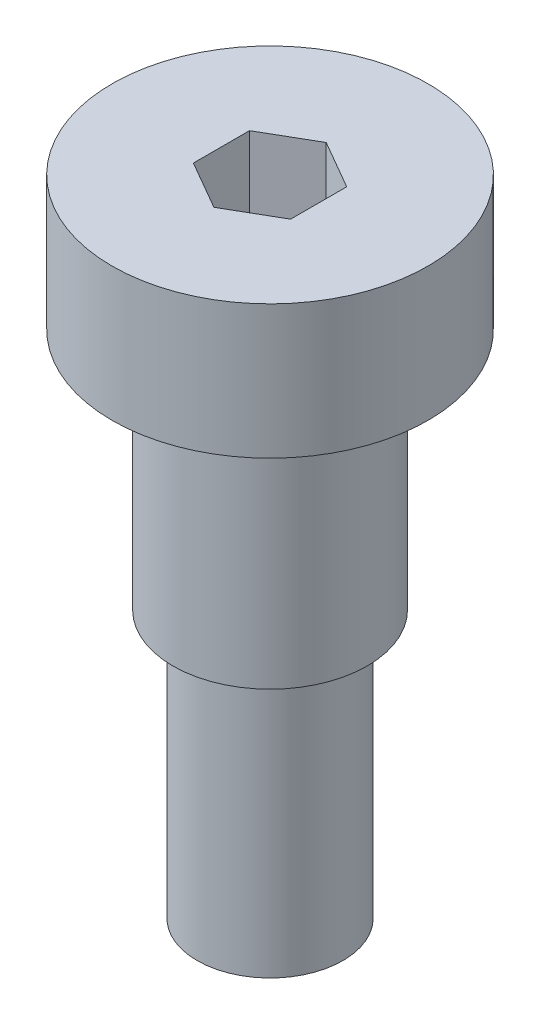
ISO-10303-21;
HEADER;
FILE_DESCRIPTION(('STEP AP214'),'2;1');
FILE_NAME('part.step','',(''),(''),'','','');
FILE_SCHEMA(('AUTOMOTIVE_DESIGN { 1 0 10303 214 1 1 1 1 }'));
ENDSEC;
DATA;
#1=APPLICATION_CONTEXT('core data for automotive mechanical design processes');
#2=APPLICATION_PROTOCOL_DEFINITION('international standard','automotive_design',2000,#1);
#3=PRODUCT_CONTEXT('',#1,'mechanical');
#4=PRODUCT('Part','Part','',(#3));
#5=PRODUCT_RELATED_PRODUCT_CATEGORY('part','',(#4));
#6=PRODUCT_DEFINITION_FORMATION('','',#4);
#7=PRODUCT_DEFINITION_CONTEXT('part definition',#1,'design');
#8=PRODUCT_DEFINITION('design','',#6,#7);
#9=PRODUCT_DEFINITION_SHAPE('','',#8);
#10=(LENGTH_UNIT() NAMED_UNIT(*) SI_UNIT(.MILLI.,.METRE.));
#11=(NAMED_UNIT(*) PLANE_ANGLE_UNIT() SI_UNIT($,.RADIAN.));
#12=(NAMED_UNIT(*) SI_UNIT($,.STERADIAN.) SOLID_ANGLE_UNIT());
#13=UNCERTAINTY_MEASURE_WITH_UNIT(LENGTH_MEASURE(1.E-05),#10,'distance_accuracy_value','');
#14=(GEOMETRIC_REPRESENTATION_CONTEXT(3) GLOBAL_UNCERTAINTY_ASSIGNED_CONTEXT((#13)) GLOBAL_UNIT_ASSIGNED_CONTEXT((#10,
#11,#12)) REPRESENTATION_CONTEXT('',''));
#15=CARTESIAN_POINT('',(0.,0.,0.));
#16=DIRECTION('',(0.,0.,1.));
#17=DIRECTION('',(1.,0.,0.));
#18=AXIS2_PLACEMENT_3D('',#15,#16,#17);
#19=CARTESIAN_POINT('',(0.,5.5,0.));
#20=DIRECTION('',(0.,-1.,0.));
#21=DIRECTION('',(0.,0.,-1.));
#22=AXIS2_PLACEMENT_3D('',#19,#20,#21);
#23=PLANE('',#22);
#24=DIRECTION('',(0.866025403784439,0.,-0.5));
#25=VECTOR('',#24,1.);
#26=CARTESIAN_POINT('',(0.,5.5,2.3094010767585));
#27=LINE('',#26,#25);
#28=CARTESIAN_POINT('',(0.,5.5,2.3094010767585));
#29=VERTEX_POINT('',#28);
#30=CARTESIAN_POINT('',(2.,5.5,1.15470053837925));
#31=VERTEX_POINT('',#30);
#32=EDGE_CURVE('E122',#29,#31,#27,.T.);
#33=ORIENTED_EDGE('',*,*,#32,.F.);
#34=DIRECTION('',(0.866025403784439,0.,0.5));
#35=VECTOR('',#34,1.);
#36=CARTESIAN_POINT('',(-2.,5.5,1.15470053837925));
#37=LINE('',#36,#35);
#38=CARTESIAN_POINT('',(-2.,5.5,1.15470053837925));
#39=VERTEX_POINT('',#38);
#40=EDGE_CURVE('E48',#39,#29,#37,.T.);
#41=ORIENTED_EDGE('',*,*,#40,.F.);
#42=DIRECTION('',(0.,0.,1.));
#43=VECTOR('',#42,1.);
#44=CARTESIAN_POINT('',(-2.,5.5,-1.15470053837925));
#45=LINE('',#44,#43);
#46=CARTESIAN_POINT('',(-2.,5.5,-1.15470053837925));
#47=VERTEX_POINT('',#46);
#48=EDGE_CURVE('E131',#47,#39,#45,.T.);
#49=ORIENTED_EDGE('',*,*,#48,.F.);
#50=DIRECTION('',(-0.866025403784439,0.,0.5));
#51=VECTOR('',#50,1.);
#52=CARTESIAN_POINT('',(0.,5.5,-2.3094010767585));
#53=LINE('',#52,#51);
#54=CARTESIAN_POINT('',(0.,5.5,-2.3094010767585));
#55=VERTEX_POINT('',#54);
#56=EDGE_CURVE('E129',#55,#47,#53,.T.);
#57=ORIENTED_EDGE('',*,*,#56,.F.);
#58=DIRECTION('',(-0.866025403784439,0.,-0.5));
#59=VECTOR('',#58,1.);
#60=CARTESIAN_POINT('',(2.,5.5,-1.15470053837925));
#61=LINE('',#60,#59);
#62=CARTESIAN_POINT('',(2.,5.5,-1.15470053837925));
#63=VERTEX_POINT('',#62);
#64=EDGE_CURVE('E96',#63,#55,#61,.T.);
#65=ORIENTED_EDGE('',*,*,#64,.F.);
#66=DIRECTION('',(0.,0.,-1.));
#67=VECTOR('',#66,1.);
#68=CARTESIAN_POINT('',(2.,5.5,1.15470053837925));
#69=LINE('',#68,#67);
#70=EDGE_CURVE('E125',#31,#63,#69,.T.);
#71=ORIENTED_EDGE('',*,*,#70,.F.);
#72=EDGE_LOOP('',(#33,#41,#49,#57,#65,#71));
#73=FACE_BOUND('',#72,.T.);
#74=CARTESIAN_POINT('',(0.,5.5,0.));
#75=DIRECTION('',(0.,1.,0.));
#76=DIRECTION('',(0.,0.,1.));
#77=AXIS2_PLACEMENT_3D('',#74,#75,#76);
#78=CIRCLE('',#77,6.5);
#79=CARTESIAN_POINT('',(0.,5.5,6.5));
#80=VERTEX_POINT('',#79);
#81=EDGE_CURVE('E11',#80,#80,#78,.T.);
#82=ORIENTED_EDGE('',*,*,#81,.T.);
#83=EDGE_LOOP('',(#82));
#84=FACE_BOUND('',#83,.T.);
#85=ADVANCED_FACE('F34',(#73,#84),#23,.F.);
#86=CARTESIAN_POINT('',(0.,24.8323599523242,0.));
#87=DIRECTION('',(0.,1.,0.));
#88=DIRECTION('',(0.,0.,1.));
#89=AXIS2_PLACEMENT_3D('',#86,#87,#88);
#90=CYLINDRICAL_SURFACE('',#89,6.5);
#91=ORIENTED_EDGE('',*,*,#81,.F.);
#92=EDGE_LOOP('',(#91));
#93=FACE_BOUND('',#92,.T.);
#94=CARTESIAN_POINT('',(0.,0.,0.));
#95=DIRECTION('',(0.,1.,0.));
#96=DIRECTION('',(0.,0.,1.));
#97=AXIS2_PLACEMENT_3D('',#94,#95,#96);
#98=CIRCLE('',#97,6.5);
#99=CARTESIAN_POINT('',(0.,0.,6.5));
#100=VERTEX_POINT('',#99);
#101=EDGE_CURVE('E41',#100,#100,#98,.T.);
#102=ORIENTED_EDGE('',*,*,#101,.T.);
#103=EDGE_LOOP('',(#102));
#104=FACE_BOUND('',#103,.T.);
#105=ADVANCED_FACE('F154',(#93,#104),#90,.T.);
#106=CARTESIAN_POINT('',(6.5,0.,0.));
#107=DIRECTION('',(0.,1.,0.));
#108=DIRECTION('',(0.,0.,1.));
#109=AXIS2_PLACEMENT_3D('',#106,#107,#108);
#110=PLANE('',#109);
#111=ORIENTED_EDGE('',*,*,#101,.F.);
#112=EDGE_LOOP('',(#111));
#113=FACE_BOUND('',#112,.T.);
#114=CARTESIAN_POINT('',(0.,0.,0.));
#115=DIRECTION('',(0.,1.,0.));
#116=DIRECTION('',(0.,0.,1.));
#117=AXIS2_PLACEMENT_3D('',#114,#115,#116);
#118=CIRCLE('',#117,4.);
#119=CARTESIAN_POINT('',(0.,0.,4.));
#120=VERTEX_POINT('',#119);
#121=EDGE_CURVE('E149',#120,#120,#118,.T.);
#122=ORIENTED_EDGE('',*,*,#121,.T.);
#123=EDGE_LOOP('',(#122));
#124=FACE_BOUND('',#123,.T.);
#125=ADVANCED_FACE('F156',(#113,#124),#110,.F.);
#126=CARTESIAN_POINT('',(0.,24.8323599523242,0.));
#127=DIRECTION('',(0.,1.,0.));
#128=DIRECTION('',(0.,0.,1.));
#129=AXIS2_PLACEMENT_3D('',#126,#127,#128);
#130=CYLINDRICAL_SURFACE('',#129,4.);
#131=ORIENTED_EDGE('',*,*,#121,.F.);
#132=EDGE_LOOP('',(#131));
#133=FACE_BOUND('',#132,.T.);
#134=CARTESIAN_POINT('',(0.,-10.,0.));
#135=DIRECTION('',(0.,1.,0.));
#136=DIRECTION('',(0.,0.,1.));
#137=AXIS2_PLACEMENT_3D('',#134,#135,#136);
#138=CIRCLE('',#137,4.);
#139=CARTESIAN_POINT('',(0.,-10.,4.));
#140=VERTEX_POINT('',#139);
#141=EDGE_CURVE('E146',#140,#140,#138,.T.);
#142=ORIENTED_EDGE('',*,*,#141,.T.);
#143=EDGE_LOOP('',(#142));
#144=FACE_BOUND('',#143,.T.);
#145=ADVANCED_FACE('F159',(#133,#144),#130,.T.);
#146=CARTESIAN_POINT('',(4.,-10.,0.));
#147=DIRECTION('',(0.,1.,0.));
#148=DIRECTION('',(0.,0.,1.));
#149=AXIS2_PLACEMENT_3D('',#146,#147,#148);
#150=PLANE('',#149);
#151=ORIENTED_EDGE('',*,*,#141,.F.);
#152=EDGE_LOOP('',(#151));
#153=FACE_BOUND('',#152,.T.);
#154=CARTESIAN_POINT('',(0.,-10.,0.));
#155=DIRECTION('',(0.,1.,0.));
#156=DIRECTION('',(0.,0.,1.));
#157=AXIS2_PLACEMENT_3D('',#154,#155,#156);
#158=CIRCLE('',#157,3.);
#159=CARTESIAN_POINT('',(0.,-10.,3.));
#160=VERTEX_POINT('',#159);
#161=EDGE_CURVE('E143',#160,#160,#158,.T.);
#162=ORIENTED_EDGE('',*,*,#161,.T.);
#163=EDGE_LOOP('',(#162));
#164=FACE_BOUND('',#163,.T.);
#165=ADVANCED_FACE('F165',(#153,#164),#150,.F.);
#166=CARTESIAN_POINT('',(0.,24.8323599523242,0.));
#167=DIRECTION('',(0.,1.,0.));
#168=DIRECTION('',(0.,0.,1.));
#169=AXIS2_PLACEMENT_3D('',#166,#167,#168);
#170=CYLINDRICAL_SURFACE('',#169,3.00000000000001);
#171=ORIENTED_EDGE('',*,*,#161,.F.);
#172=EDGE_LOOP('',(#171));
#173=FACE_BOUND('',#172,.T.);
#174=CARTESIAN_POINT('',(0.,-21.,0.));
#175=DIRECTION('',(0.,1.,0.));
#176=DIRECTION('',(0.,0.,1.));
#177=AXIS2_PLACEMENT_3D('',#174,#175,#176);
#178=CIRCLE('',#177,3.00000000000001);
#179=CARTESIAN_POINT('',(0.,-21.,3.00000000000001));
#180=VERTEX_POINT('',#179);
#181=EDGE_CURVE('E135',#180,#180,#178,.T.);
#182=ORIENTED_EDGE('',*,*,#181,.T.);
#183=EDGE_LOOP('',(#182));
#184=FACE_BOUND('',#183,.T.);
#185=ADVANCED_FACE('F171',(#173,#184),#170,.T.);
#186=CARTESIAN_POINT('',(3.00000000000001,-21.,0.));
#187=DIRECTION('',(0.,1.,0.));
#188=DIRECTION('',(0.,0.,1.));
#189=AXIS2_PLACEMENT_3D('',#186,#187,#188);
#190=PLANE('',#189);
#191=ORIENTED_EDGE('',*,*,#181,.F.);
#192=EDGE_LOOP('',(#191));
#193=FACE_BOUND('',#192,.T.);
#194=ADVANCED_FACE('F177',(#193),#190,.F.);
#195=CARTESIAN_POINT('',(-2.,2.5,1.15470053837925));
#196=DIRECTION('',(-0.5,0.,0.866025403784439));
#197=DIRECTION('',(0.866025403784439,0.,0.5));
#198=AXIS2_PLACEMENT_3D('',#195,#196,#197);
#199=PLANE('',#198);
#200=ORIENTED_EDGE('',*,*,#40,.T.);
#201=DIRECTION('',(0.,1.,0.));
#202=VECTOR('',#201,1.);
#203=CARTESIAN_POINT('',(0.,2.5,2.3094010767585));
#204=LINE('',#203,#202);
#205=CARTESIAN_POINT('',(0.,2.5,2.3094010767585));
#206=VERTEX_POINT('',#205);
#207=EDGE_CURVE('E78',#206,#29,#204,.T.);
#208=ORIENTED_EDGE('',*,*,#207,.F.);
#209=DIRECTION('',(0.866025403784439,0.,0.5));
#210=VECTOR('',#209,1.);
#211=CARTESIAN_POINT('',(-2.,2.5,1.15470053837925));
#212=LINE('',#211,#210);
#213=CARTESIAN_POINT('',(-2.,2.5,1.15470053837925));
#214=VERTEX_POINT('',#213);
#215=EDGE_CURVE('E133',#214,#206,#212,.T.);
#216=ORIENTED_EDGE('',*,*,#215,.F.);
#217=DIRECTION('',(0.,1.,0.));
#218=VECTOR('',#217,1.);
#219=CARTESIAN_POINT('',(-2.,2.5,1.15470053837925));
#220=LINE('',#219,#218);
#221=EDGE_CURVE('E56',#214,#39,#220,.T.);
#222=ORIENTED_EDGE('',*,*,#221,.T.);
#223=EDGE_LOOP('',(#200,#208,#216,#222));
#224=FACE_BOUND('',#223,.T.);
#225=ADVANCED_FACE('F182',(#224),#199,.F.);
#226=CARTESIAN_POINT('',(-2.,2.5,-1.15470053837925));
#227=DIRECTION('',(-1.,0.,0.));
#228=DIRECTION('',(0.,0.,1.));
#229=AXIS2_PLACEMENT_3D('',#226,#227,#228);
#230=PLANE('',#229);
#231=ORIENTED_EDGE('',*,*,#48,.T.);
#232=ORIENTED_EDGE('',*,*,#221,.F.);
#233=DIRECTION('',(0.,0.,1.));
#234=VECTOR('',#233,1.);
#235=CARTESIAN_POINT('',(-2.,2.5,-1.15470053837925));
#236=LINE('',#235,#234);
#237=CARTESIAN_POINT('',(-2.,2.5,-1.15470053837925));
#238=VERTEX_POINT('',#237);
#239=EDGE_CURVE('E108',#238,#214,#236,.T.);
#240=ORIENTED_EDGE('',*,*,#239,.F.);
#241=DIRECTION('',(0.,1.,0.));
#242=VECTOR('',#241,1.);
#243=CARTESIAN_POINT('',(-2.,2.5,-1.15470053837925));
#244=LINE('',#243,#242);
#245=EDGE_CURVE('E100',#238,#47,#244,.T.);
#246=ORIENTED_EDGE('',*,*,#245,.T.);
#247=EDGE_LOOP('',(#231,#232,#240,#246));
#248=FACE_BOUND('',#247,.T.);
#249=ADVANCED_FACE('F187',(#248),#230,.F.);
#250=CARTESIAN_POINT('',(0.,2.5,-2.3094010767585));
#251=DIRECTION('',(-0.5,0.,-0.866025403784439));
#252=DIRECTION('',(-0.866025403784439,0.,0.5));
#253=AXIS2_PLACEMENT_3D('',#250,#251,#252);
#254=PLANE('',#253);
#255=ORIENTED_EDGE('',*,*,#56,.T.);
#256=ORIENTED_EDGE('',*,*,#245,.F.);
#257=DIRECTION('',(-0.866025403784439,0.,0.5));
#258=VECTOR('',#257,1.);
#259=CARTESIAN_POINT('',(0.,2.5,-2.3094010767585));
#260=LINE('',#259,#258);
#261=CARTESIAN_POINT('',(0.,2.5,-2.3094010767585));
#262=VERTEX_POINT('',#261);
#263=EDGE_CURVE('E104',#262,#238,#260,.T.);
#264=ORIENTED_EDGE('',*,*,#263,.F.);
#265=DIRECTION('',(0.,1.,0.));
#266=VECTOR('',#265,1.);
#267=CARTESIAN_POINT('',(0.,2.5,-2.3094010767585));
#268=LINE('',#267,#266);
#269=EDGE_CURVE('E89',#262,#55,#268,.T.);
#270=ORIENTED_EDGE('',*,*,#269,.T.);
#271=EDGE_LOOP('',(#255,#256,#264,#270));
#272=FACE_BOUND('',#271,.T.);
#273=ADVANCED_FACE('F105',(#272),#254,.F.);
#274=CARTESIAN_POINT('',(2.,2.5,-1.15470053837925));
#275=DIRECTION('',(0.5,0.,-0.866025403784439));
#276=DIRECTION('',(-0.866025403784439,0.,-0.5));
#277=AXIS2_PLACEMENT_3D('',#274,#275,#276);
#278=PLANE('',#277);
#279=ORIENTED_EDGE('',*,*,#64,.T.);
#280=ORIENTED_EDGE('',*,*,#269,.F.);
#281=DIRECTION('',(-0.866025403784439,0.,-0.5));
#282=VECTOR('',#281,1.);
#283=CARTESIAN_POINT('',(2.,2.5,-1.15470053837925));
#284=LINE('',#283,#282);
#285=CARTESIAN_POINT('',(2.,2.5,-1.15470053837925));
#286=VERTEX_POINT('',#285);
#287=EDGE_CURVE('E93',#286,#262,#284,.T.);
#288=ORIENTED_EDGE('',*,*,#287,.F.);
#289=DIRECTION('',(0.,1.,0.));
#290=VECTOR('',#289,1.);
#291=CARTESIAN_POINT('',(2.,2.5,-1.15470053837925));
#292=LINE('',#291,#290);
#293=EDGE_CURVE('E101',#286,#63,#292,.T.);
#294=ORIENTED_EDGE('',*,*,#293,.T.);
#295=EDGE_LOOP('',(#279,#280,#288,#294));
#296=FACE_BOUND('',#295,.T.);
#297=ADVANCED_FACE('F91',(#296),#278,.F.);
#298=CARTESIAN_POINT('',(2.,2.5,1.15470053837925));
#299=DIRECTION('',(1.,0.,0.));
#300=DIRECTION('',(0.,0.,-1.));
#301=AXIS2_PLACEMENT_3D('',#298,#299,#300);
#302=PLANE('',#301);
#303=ORIENTED_EDGE('',*,*,#70,.T.);
#304=ORIENTED_EDGE('',*,*,#293,.F.);
#305=DIRECTION('',(0.,0.,-1.));
#306=VECTOR('',#305,1.);
#307=CARTESIAN_POINT('',(2.,2.5,1.15470053837925));
#308=LINE('',#307,#306);
#309=CARTESIAN_POINT('',(2.,2.5,1.15470053837925));
#310=VERTEX_POINT('',#309);
#311=EDGE_CURVE('E114',#310,#286,#308,.T.);
#312=ORIENTED_EDGE('',*,*,#311,.F.);
#313=DIRECTION('',(0.,1.,0.));
#314=VECTOR('',#313,1.);
#315=CARTESIAN_POINT('',(2.,2.5,1.15470053837925));
#316=LINE('',#315,#314);
#317=EDGE_CURVE('E138',#310,#31,#316,.T.);
#318=ORIENTED_EDGE('',*,*,#317,.T.);
#319=EDGE_LOOP('',(#303,#304,#312,#318));
#320=FACE_BOUND('',#319,.T.);
#321=ADVANCED_FACE('F213',(#320),#302,.F.);
#322=CARTESIAN_POINT('',(0.,2.5,2.3094010767585));
#323=DIRECTION('',(0.5,0.,0.866025403784438));
#324=DIRECTION('',(0.866025403784439,0.,-0.5));
#325=AXIS2_PLACEMENT_3D('',#322,#323,#324);
#326=PLANE('',#325);
#327=ORIENTED_EDGE('',*,*,#32,.T.);
#328=ORIENTED_EDGE('',*,*,#317,.F.);
#329=DIRECTION('',(0.866025403784439,0.,-0.5));
#330=VECTOR('',#329,1.);
#331=CARTESIAN_POINT('',(0.,2.5,2.3094010767585));
#332=LINE('',#331,#330);
#333=EDGE_CURVE('E116',#206,#310,#332,.T.);
#334=ORIENTED_EDGE('',*,*,#333,.F.);
#335=ORIENTED_EDGE('',*,*,#207,.T.);
#336=EDGE_LOOP('',(#327,#328,#334,#335));
#337=FACE_BOUND('',#336,.T.);
#338=ADVANCED_FACE('F201',(#337),#326,.F.);
#339=CARTESIAN_POINT('',(-2.,2.5,1.15470053837925));
#340=DIRECTION('',(0.,-1.,0.));
#341=DIRECTION('',(0.,0.,-1.));
#342=AXIS2_PLACEMENT_3D('',#339,#340,#341);
#343=PLANE('',#342);
#344=ORIENTED_EDGE('',*,*,#215,.T.);
#345=ORIENTED_EDGE('',*,*,#333,.T.);
#346=ORIENTED_EDGE('',*,*,#311,.T.);
#347=ORIENTED_EDGE('',*,*,#287,.T.);
#348=ORIENTED_EDGE('',*,*,#263,.T.);
#349=ORIENTED_EDGE('',*,*,#239,.T.);
#350=EDGE_LOOP('',(#344,#345,#346,#347,#348,#349));
#351=FACE_BOUND('',#350,.T.);
#352=ADVANCED_FACE('F111',(#351),#343,.F.);
#353=CLOSED_SHELL('',(#85,#105,#125,#145,#165,#185,#194,#225,#249,#273,#297,#321,#338,#352));
#354=MANIFOLD_SOLID_BREP('B2',#353);
#355=ADVANCED_BREP_SHAPE_REPRESENTATION('',(#18,#354),#14);
#356=SHAPE_DEFINITION_REPRESENTATION(#9,#355);
ENDSEC;
END-ISO-10303-21;
